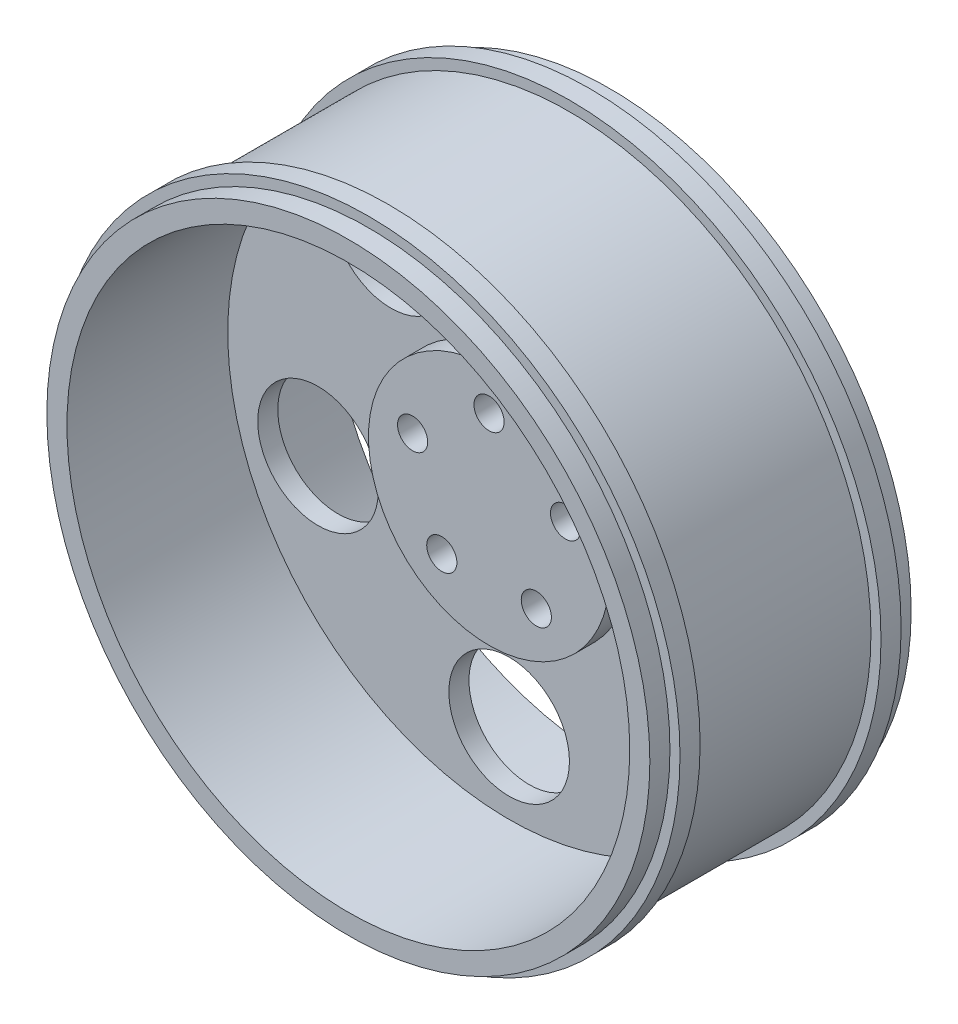
ISO-10303-21;
HEADER;
FILE_DESCRIPTION(('STEP AP214'),'2;1');
FILE_NAME('part.step','',(''),(''),'','','');
FILE_SCHEMA(('AUTOMOTIVE_DESIGN { 1 0 10303 214 1 1 1 1 }'));
ENDSEC;
DATA;
#1=APPLICATION_CONTEXT('core data for automotive mechanical design processes');
#2=APPLICATION_PROTOCOL_DEFINITION('international standard','automotive_design',2000,#1);
#3=PRODUCT_CONTEXT('',#1,'mechanical');
#4=PRODUCT('Part','Part','',(#3));
#5=PRODUCT_RELATED_PRODUCT_CATEGORY('part','',(#4));
#6=PRODUCT_DEFINITION_FORMATION('','',#4);
#7=PRODUCT_DEFINITION_CONTEXT('part definition',#1,'design');
#8=PRODUCT_DEFINITION('design','',#6,#7);
#9=PRODUCT_DEFINITION_SHAPE('','',#8);
#10=(LENGTH_UNIT() NAMED_UNIT(*) SI_UNIT(.MILLI.,.METRE.));
#11=(NAMED_UNIT(*) PLANE_ANGLE_UNIT() SI_UNIT($,.RADIAN.));
#12=(NAMED_UNIT(*) SI_UNIT($,.STERADIAN.) SOLID_ANGLE_UNIT());
#13=UNCERTAINTY_MEASURE_WITH_UNIT(LENGTH_MEASURE(1.E-05),#10,'distance_accuracy_value','');
#14=(GEOMETRIC_REPRESENTATION_CONTEXT(3) GLOBAL_UNCERTAINTY_ASSIGNED_CONTEXT((#13)) GLOBAL_UNIT_ASSIGNED_CONTEXT((#10,
#11,#12)) REPRESENTATION_CONTEXT('',''));
#15=CARTESIAN_POINT('',(0.,0.,0.));
#16=DIRECTION('',(0.,0.,1.));
#17=DIRECTION('',(1.,0.,0.));
#18=AXIS2_PLACEMENT_3D('',#15,#16,#17);
#19=CARTESIAN_POINT('',(0.,140.,0.));
#20=DIRECTION('',(0.,0.,-1.));
#21=DIRECTION('',(-1.,0.,0.));
#22=AXIS2_PLACEMENT_3D('',#19,#20,#21);
#23=PLANE('',#22);
#24=CARTESIAN_POINT('',(-58.7785252292473,80.9016994374947,0.));
#25=DIRECTION('',(0.,0.,1.));
#26=DIRECTION('',(1.,0.,0.));
#27=AXIS2_PLACEMENT_3D('',#24,#25,#26);
#28=CIRCLE('',#27,30.);
#29=CARTESIAN_POINT('',(-28.7785252292473,80.9016994374947,0.));
#30=VERTEX_POINT('',#29);
#31=EDGE_CURVE('E425',#30,#30,#28,.T.);
#32=ORIENTED_EDGE('',*,*,#31,.F.);
#33=EDGE_LOOP('',(#32));
#34=FACE_BOUND('',#33,.T.);
#35=CARTESIAN_POINT('',(0.,-100.,0.));
#36=DIRECTION('',(0.,0.,1.));
#37=DIRECTION('',(1.,0.,0.));
#38=AXIS2_PLACEMENT_3D('',#35,#36,#37);
#39=CIRCLE('',#38,30.);
#40=CARTESIAN_POINT('',(30.,-100.,0.));
#41=VERTEX_POINT('',#40);
#42=EDGE_CURVE('E426',#41,#41,#39,.T.);
#43=ORIENTED_EDGE('',*,*,#42,.F.);
#44=EDGE_LOOP('',(#43));
#45=FACE_BOUND('',#44,.T.);
#46=CARTESIAN_POINT('',(95.1056516295154,-30.9016994374947,0.));
#47=DIRECTION('',(0.,0.,1.));
#48=DIRECTION('',(1.,0.,0.));
#49=AXIS2_PLACEMENT_3D('',#46,#47,#48);
#50=CIRCLE('',#49,29.9999999999999);
#51=CARTESIAN_POINT('',(125.105651629515,-30.9016994374947,0.));
#52=VERTEX_POINT('',#51);
#53=EDGE_CURVE('E432',#52,#52,#50,.T.);
#54=ORIENTED_EDGE('',*,*,#53,.F.);
#55=EDGE_LOOP('',(#54));
#56=FACE_BOUND('',#55,.T.);
#57=CARTESIAN_POINT('',(58.7785252292473,80.9016994374948,0.));
#58=DIRECTION('',(0.,0.,1.));
#59=DIRECTION('',(1.,0.,0.));
#60=AXIS2_PLACEMENT_3D('',#57,#58,#59);
#61=CIRCLE('',#60,29.9999999999999);
#62=CARTESIAN_POINT('',(88.7785252292473,80.9016994374948,0.));
#63=VERTEX_POINT('',#62);
#64=EDGE_CURVE('E429',#63,#63,#61,.T.);
#65=ORIENTED_EDGE('',*,*,#64,.F.);
#66=EDGE_LOOP('',(#65));
#67=FACE_BOUND('',#66,.T.);
#68=CARTESIAN_POINT('',(0.,0.,0.));
#69=DIRECTION('',(0.,0.,1.));
#70=DIRECTION('',(1.,0.,0.));
#71=AXIS2_PLACEMENT_3D('',#68,#69,#70);
#72=CIRCLE('',#71,60.);
#73=CARTESIAN_POINT('',(60.,0.,0.));
#74=VERTEX_POINT('',#73);
#75=EDGE_CURVE('E83',#74,#74,#72,.T.);
#76=ORIENTED_EDGE('',*,*,#75,.F.);
#77=EDGE_LOOP('',(#76));
#78=FACE_BOUND('',#77,.T.);
#79=CARTESIAN_POINT('',(0.,0.,0.));
#80=DIRECTION('',(0.,0.,1.));
#81=DIRECTION('',(1.,0.,0.));
#82=AXIS2_PLACEMENT_3D('',#79,#80,#81);
#83=CIRCLE('',#82,140.);
#84=CARTESIAN_POINT('',(140.,0.,0.));
#85=VERTEX_POINT('',#84);
#86=EDGE_CURVE('E86',#85,#85,#83,.T.);
#87=ORIENTED_EDGE('',*,*,#86,.T.);
#88=EDGE_LOOP('',(#87));
#89=FACE_BOUND('',#88,.T.);
#90=CARTESIAN_POINT('',(-95.1056516295154,-30.9016994374948,0.));
#91=DIRECTION('',(0.,0.,1.));
#92=DIRECTION('',(1.,0.,0.));
#93=AXIS2_PLACEMENT_3D('',#90,#91,#92);
#94=CIRCLE('',#93,30.);
#95=CARTESIAN_POINT('',(-65.1056516295154,-30.9016994374948,0.));
#96=VERTEX_POINT('',#95);
#97=EDGE_CURVE('E396',#96,#96,#94,.T.);
#98=ORIENTED_EDGE('',*,*,#97,.F.);
#99=EDGE_LOOP('',(#98));
#100=FACE_BOUND('',#99,.T.);
#101=ADVANCED_FACE('F34',(#34,#45,#56,#67,#78,#89,#100),#23,.F.);
#102=CARTESIAN_POINT('',(0.,60.,9.99999999999999));
#103=DIRECTION('',(0.,0.,-1.));
#104=DIRECTION('',(-1.,0.,0.));
#105=AXIS2_PLACEMENT_3D('',#102,#103,#104);
#106=PLANE('',#105);
#107=CARTESIAN_POINT('',(0.,40.,9.99999999999999));
#108=DIRECTION('',(0.,0.,-1.));
#109=DIRECTION('',(-1.,0.,0.));
#110=AXIS2_PLACEMENT_3D('',#107,#108,#109);
#111=CIRCLE('',#110,7.5);
#112=CARTESIAN_POINT('',(-7.5,40.,9.99999999999999));
#113=VERTEX_POINT('',#112);
#114=EDGE_CURVE('E68',#113,#113,#111,.T.);
#115=ORIENTED_EDGE('',*,*,#114,.T.);
#116=EDGE_LOOP('',(#115));
#117=FACE_BOUND('',#116,.T.);
#118=CARTESIAN_POINT('',(38.0422606518061,12.3606797749979,9.99999999999999));
#119=DIRECTION('',(0.,0.,-1.));
#120=DIRECTION('',(-1.,0.,0.));
#121=AXIS2_PLACEMENT_3D('',#118,#119,#120);
#122=CIRCLE('',#121,7.50000000000001);
#123=CARTESIAN_POINT('',(30.5422606518061,12.3606797749979,9.99999999999999));
#124=VERTEX_POINT('',#123);
#125=EDGE_CURVE('E65',#124,#124,#122,.T.);
#126=ORIENTED_EDGE('',*,*,#125,.T.);
#127=EDGE_LOOP('',(#126));
#128=FACE_BOUND('',#127,.T.);
#129=CARTESIAN_POINT('',(23.5114100916989,-32.3606797749979,9.99999999999999));
#130=DIRECTION('',(0.,0.,-1.));
#131=DIRECTION('',(-1.,0.,0.));
#132=AXIS2_PLACEMENT_3D('',#129,#130,#131);
#133=CIRCLE('',#132,7.50000000000001);
#134=CARTESIAN_POINT('',(16.0114100916989,-32.3606797749979,9.99999999999999));
#135=VERTEX_POINT('',#134);
#136=EDGE_CURVE('E62',#135,#135,#133,.T.);
#137=ORIENTED_EDGE('',*,*,#136,.T.);
#138=EDGE_LOOP('',(#137));
#139=FACE_BOUND('',#138,.T.);
#140=CARTESIAN_POINT('',(-23.5114100916989,-32.3606797749979,9.99999999999999));
#141=DIRECTION('',(0.,0.,-1.));
#142=DIRECTION('',(-1.,0.,0.));
#143=AXIS2_PLACEMENT_3D('',#140,#141,#142);
#144=CIRCLE('',#143,7.5);
#145=CARTESIAN_POINT('',(-31.0114100916989,-32.3606797749979,9.99999999999999));
#146=VERTEX_POINT('',#145);
#147=EDGE_CURVE('E58',#146,#146,#144,.T.);
#148=ORIENTED_EDGE('',*,*,#147,.T.);
#149=EDGE_LOOP('',(#148));
#150=FACE_BOUND('',#149,.T.);
#151=CARTESIAN_POINT('',(-38.0422606518061,12.3606797749979,9.99999999999999));
#152=DIRECTION('',(0.,0.,-1.));
#153=DIRECTION('',(-1.,0.,0.));
#154=AXIS2_PLACEMENT_3D('',#151,#152,#153);
#155=CIRCLE('',#154,7.5);
#156=CARTESIAN_POINT('',(-45.5422606518061,12.3606797749979,9.99999999999999));
#157=VERTEX_POINT('',#156);
#158=EDGE_CURVE('E54',#157,#157,#155,.T.);
#159=ORIENTED_EDGE('',*,*,#158,.T.);
#160=EDGE_LOOP('',(#159));
#161=FACE_BOUND('',#160,.T.);
#162=CARTESIAN_POINT('',(0.,0.,9.99999999999999));
#163=DIRECTION('',(0.,0.,1.));
#164=DIRECTION('',(1.,0.,0.));
#165=AXIS2_PLACEMENT_3D('',#162,#163,#164);
#166=CIRCLE('',#165,60.);
#167=CARTESIAN_POINT('',(60.,0.,9.99999999999999));
#168=VERTEX_POINT('',#167);
#169=EDGE_CURVE('E72',#168,#168,#166,.T.);
#170=ORIENTED_EDGE('',*,*,#169,.T.);
#171=EDGE_LOOP('',(#170));
#172=FACE_BOUND('',#171,.T.);
#173=ADVANCED_FACE('F36',(#117,#128,#139,#150,#161,#172),#106,.F.);
#174=CARTESIAN_POINT('',(0.,0.,-10.));
#175=DIRECTION('',(0.,0.,1.));
#176=DIRECTION('',(1.,0.,0.));
#177=AXIS2_PLACEMENT_3D('',#174,#175,#176);
#178=PLANE('',#177);
#179=CARTESIAN_POINT('',(-58.7785252292473,80.9016994374947,-10.));
#180=DIRECTION('',(0.,0.,1.));
#181=DIRECTION('',(1.,0.,0.));
#182=AXIS2_PLACEMENT_3D('',#179,#180,#181);
#183=CIRCLE('',#182,30.);
#184=CARTESIAN_POINT('',(-28.7785252292473,80.9016994374947,-10.));
#185=VERTEX_POINT('',#184);
#186=EDGE_CURVE('E400',#185,#185,#183,.T.);
#187=ORIENTED_EDGE('',*,*,#186,.T.);
#188=EDGE_LOOP('',(#187));
#189=FACE_BOUND('',#188,.T.);
#190=CARTESIAN_POINT('',(-95.1056516295154,-30.9016994374948,-10.));
#191=DIRECTION('',(0.,0.,1.));
#192=DIRECTION('',(1.,0.,0.));
#193=AXIS2_PLACEMENT_3D('',#190,#191,#192);
#194=CIRCLE('',#193,30.);
#195=CARTESIAN_POINT('',(-65.1056516295154,-30.9016994374948,-10.));
#196=VERTEX_POINT('',#195);
#197=EDGE_CURVE('E38',#196,#196,#194,.T.);
#198=ORIENTED_EDGE('',*,*,#197,.T.);
#199=EDGE_LOOP('',(#198));
#200=FACE_BOUND('',#199,.T.);
#201=CARTESIAN_POINT('',(0.,-100.,-10.));
#202=DIRECTION('',(0.,0.,1.));
#203=DIRECTION('',(1.,0.,0.));
#204=AXIS2_PLACEMENT_3D('',#201,#202,#203);
#205=CIRCLE('',#204,30.);
#206=CARTESIAN_POINT('',(30.,-100.,-10.));
#207=VERTEX_POINT('',#206);
#208=EDGE_CURVE('E402',#207,#207,#205,.T.);
#209=ORIENTED_EDGE('',*,*,#208,.T.);
#210=EDGE_LOOP('',(#209));
#211=FACE_BOUND('',#210,.T.);
#212=CARTESIAN_POINT('',(95.1056516295154,-30.9016994374947,-10.));
#213=DIRECTION('',(0.,0.,1.));
#214=DIRECTION('',(1.,0.,0.));
#215=AXIS2_PLACEMENT_3D('',#212,#213,#214);
#216=CIRCLE('',#215,29.9999999999999);
#217=CARTESIAN_POINT('',(125.105651629515,-30.9016994374947,-10.));
#218=VERTEX_POINT('',#217);
#219=EDGE_CURVE('E406',#218,#218,#216,.T.);
#220=ORIENTED_EDGE('',*,*,#219,.T.);
#221=EDGE_LOOP('',(#220));
#222=FACE_BOUND('',#221,.T.);
#223=CARTESIAN_POINT('',(58.7785252292473,80.9016994374948,-10.));
#224=DIRECTION('',(0.,0.,1.));
#225=DIRECTION('',(1.,0.,0.));
#226=AXIS2_PLACEMENT_3D('',#223,#224,#225);
#227=CIRCLE('',#226,29.9999999999999);
#228=CARTESIAN_POINT('',(88.7785252292473,80.9016994374948,-10.));
#229=VERTEX_POINT('',#228);
#230=EDGE_CURVE('E438',#229,#229,#227,.T.);
#231=ORIENTED_EDGE('',*,*,#230,.T.);
#232=EDGE_LOOP('',(#231));
#233=FACE_BOUND('',#232,.T.);
#234=CARTESIAN_POINT('',(0.,40.,-10.));
#235=DIRECTION('',(0.,0.,1.));
#236=DIRECTION('',(1.,0.,0.));
#237=AXIS2_PLACEMENT_3D('',#234,#235,#236);
#238=CIRCLE('',#237,7.5);
#239=CARTESIAN_POINT('',(7.5,40.,-10.));
#240=VERTEX_POINT('',#239);
#241=EDGE_CURVE('E66',#240,#240,#238,.T.);
#242=ORIENTED_EDGE('',*,*,#241,.T.);
#243=EDGE_LOOP('',(#242));
#244=FACE_BOUND('',#243,.T.);
#245=CARTESIAN_POINT('',(38.0422606518061,12.3606797749979,-10.));
#246=DIRECTION('',(0.,0.,1.));
#247=DIRECTION('',(1.,0.,0.));
#248=AXIS2_PLACEMENT_3D('',#245,#246,#247);
#249=CIRCLE('',#248,7.50000000000001);
#250=CARTESIAN_POINT('',(45.5422606518062,12.3606797749979,-10.));
#251=VERTEX_POINT('',#250);
#252=EDGE_CURVE('E63',#251,#251,#249,.T.);
#253=ORIENTED_EDGE('',*,*,#252,.T.);
#254=EDGE_LOOP('',(#253));
#255=FACE_BOUND('',#254,.T.);
#256=CARTESIAN_POINT('',(23.5114100916989,-32.3606797749979,-10.));
#257=DIRECTION('',(0.,0.,1.));
#258=DIRECTION('',(1.,0.,0.));
#259=AXIS2_PLACEMENT_3D('',#256,#257,#258);
#260=CIRCLE('',#259,7.50000000000001);
#261=CARTESIAN_POINT('',(31.0114100916989,-32.3606797749979,-10.));
#262=VERTEX_POINT('',#261);
#263=EDGE_CURVE('E59',#262,#262,#260,.T.);
#264=ORIENTED_EDGE('',*,*,#263,.T.);
#265=EDGE_LOOP('',(#264));
#266=FACE_BOUND('',#265,.T.);
#267=CARTESIAN_POINT('',(-23.5114100916989,-32.3606797749979,-10.));
#268=DIRECTION('',(0.,0.,1.));
#269=DIRECTION('',(1.,0.,0.));
#270=AXIS2_PLACEMENT_3D('',#267,#268,#269);
#271=CIRCLE('',#270,7.5);
#272=CARTESIAN_POINT('',(-16.0114100916989,-32.3606797749979,-10.));
#273=VERTEX_POINT('',#272);
#274=EDGE_CURVE('E55',#273,#273,#271,.T.);
#275=ORIENTED_EDGE('',*,*,#274,.T.);
#276=EDGE_LOOP('',(#275));
#277=FACE_BOUND('',#276,.T.);
#278=CARTESIAN_POINT('',(-38.0422606518061,12.3606797749979,-10.));
#279=DIRECTION('',(0.,0.,1.));
#280=DIRECTION('',(1.,0.,0.));
#281=AXIS2_PLACEMENT_3D('',#278,#279,#280);
#282=CIRCLE('',#281,7.5);
#283=CARTESIAN_POINT('',(-30.5422606518061,12.3606797749979,-10.));
#284=VERTEX_POINT('',#283);
#285=EDGE_CURVE('E51',#284,#284,#282,.T.);
#286=ORIENTED_EDGE('',*,*,#285,.T.);
#287=EDGE_LOOP('',(#286));
#288=FACE_BOUND('',#287,.T.);
#289=CARTESIAN_POINT('',(0.,0.,-10.));
#290=DIRECTION('',(0.,0.,1.));
#291=DIRECTION('',(1.,0.,0.));
#292=AXIS2_PLACEMENT_3D('',#289,#290,#291);
#293=CIRCLE('',#292,140.);
#294=CARTESIAN_POINT('',(140.,0.,-10.));
#295=VERTEX_POINT('',#294);
#296=EDGE_CURVE('E10',#295,#295,#293,.T.);
#297=ORIENTED_EDGE('',*,*,#296,.F.);
#298=EDGE_LOOP('',(#297));
#299=FACE_BOUND('',#298,.T.);
#300=ADVANCED_FACE('F131',(#189,#200,#211,#222,#233,#244,#255,#266,#277,#288,#299),#178,.F.);
#301=CARTESIAN_POINT('',(0.,0.,9.99999999999998));
#302=DIRECTION('',(0.,0.,1.));
#303=DIRECTION('',(1.,0.,0.));
#304=AXIS2_PLACEMENT_3D('',#301,#302,#303);
#305=CYLINDRICAL_SURFACE('',#304,140.);
#306=CARTESIAN_POINT('',(0.,0.,-50.));
#307=DIRECTION('',(0.,0.,1.));
#308=DIRECTION('',(1.,0.,0.));
#309=AXIS2_PLACEMENT_3D('',#306,#307,#308);
#310=CIRCLE('',#309,140.);
#311=CARTESIAN_POINT('',(140.,0.,-50.));
#312=VERTEX_POINT('',#311);
#313=EDGE_CURVE('E42',#312,#312,#310,.T.);
#314=ORIENTED_EDGE('',*,*,#313,.F.);
#315=EDGE_LOOP('',(#314));
#316=FACE_BOUND('',#315,.T.);
#317=ORIENTED_EDGE('',*,*,#296,.T.);
#318=EDGE_LOOP('',(#317));
#319=FACE_BOUND('',#318,.T.);
#320=ADVANCED_FACE('F126',(#316,#319),#305,.F.);
#321=CARTESIAN_POINT('',(0.,140.,-50.));
#322=DIRECTION('',(0.,0.,1.));
#323=DIRECTION('',(1.,0.,0.));
#324=AXIS2_PLACEMENT_3D('',#321,#322,#323);
#325=PLANE('',#324);
#326=CARTESIAN_POINT('',(0.,0.,-50.));
#327=DIRECTION('',(0.,0.,1.));
#328=DIRECTION('',(1.,0.,0.));
#329=AXIS2_PLACEMENT_3D('',#326,#327,#328);
#330=CIRCLE('',#329,150.);
#331=CARTESIAN_POINT('',(150.,0.,-50.));
#332=VERTEX_POINT('',#331);
#333=EDGE_CURVE('E47',#332,#332,#330,.T.);
#334=ORIENTED_EDGE('',*,*,#333,.F.);
#335=EDGE_LOOP('',(#334));
#336=FACE_BOUND('',#335,.T.);
#337=ORIENTED_EDGE('',*,*,#313,.T.);
#338=EDGE_LOOP('',(#337));
#339=FACE_BOUND('',#338,.T.);
#340=ADVANCED_FACE('F123',(#336,#339),#325,.F.);
#341=CARTESIAN_POINT('',(0.,0.,9.99999999999998));
#342=DIRECTION('',(0.,0.,1.));
#343=DIRECTION('',(1.,0.,0.));
#344=AXIS2_PLACEMENT_3D('',#341,#342,#343);
#345=CYLINDRICAL_SURFACE('',#344,150.);
#346=CARTESIAN_POINT('',(0.,0.,-40.));
#347=DIRECTION('',(0.,0.,1.));
#348=DIRECTION('',(1.,0.,0.));
#349=AXIS2_PLACEMENT_3D('',#346,#347,#348);
#350=CIRCLE('',#349,150.);
#351=CARTESIAN_POINT('',(150.,0.,-40.));
#352=VERTEX_POINT('',#351);
#353=EDGE_CURVE('E116',#352,#352,#350,.T.);
#354=ORIENTED_EDGE('',*,*,#353,.F.);
#355=EDGE_LOOP('',(#354));
#356=FACE_BOUND('',#355,.T.);
#357=ORIENTED_EDGE('',*,*,#333,.T.);
#358=EDGE_LOOP('',(#357));
#359=FACE_BOUND('',#358,.T.);
#360=ADVANCED_FACE('F121',(#356,#359),#345,.T.);
#361=CARTESIAN_POINT('',(0.,150.,-40.));
#362=DIRECTION('',(0.,0.,1.));
#363=DIRECTION('',(1.,0.,0.));
#364=AXIS2_PLACEMENT_3D('',#361,#362,#363);
#365=PLANE('',#364);
#366=CARTESIAN_POINT('',(0.,0.,-40.));
#367=DIRECTION('',(0.,0.,1.));
#368=DIRECTION('',(1.,0.,0.));
#369=AXIS2_PLACEMENT_3D('',#366,#367,#368);
#370=CIRCLE('',#369,155.);
#371=CARTESIAN_POINT('',(155.,0.,-40.));
#372=VERTEX_POINT('',#371);
#373=EDGE_CURVE('E113',#372,#372,#370,.T.);
#374=ORIENTED_EDGE('',*,*,#373,.F.);
#375=EDGE_LOOP('',(#374));
#376=FACE_BOUND('',#375,.T.);
#377=ORIENTED_EDGE('',*,*,#353,.T.);
#378=EDGE_LOOP('',(#377));
#379=FACE_BOUND('',#378,.T.);
#380=ADVANCED_FACE('F185',(#376,#379),#365,.F.);
#381=CARTESIAN_POINT('',(0.,0.,9.99999999999998));
#382=DIRECTION('',(0.,0.,1.));
#383=DIRECTION('',(1.,0.,0.));
#384=AXIS2_PLACEMENT_3D('',#381,#382,#383);
#385=CYLINDRICAL_SURFACE('',#384,155.);
#386=CARTESIAN_POINT('',(0.,0.,-30.));
#387=DIRECTION('',(0.,0.,1.));
#388=DIRECTION('',(1.,0.,0.));
#389=AXIS2_PLACEMENT_3D('',#386,#387,#388);
#390=CIRCLE('',#389,155.);
#391=CARTESIAN_POINT('',(155.,0.,-30.));
#392=VERTEX_POINT('',#391);
#393=EDGE_CURVE('E110',#392,#392,#390,.T.);
#394=ORIENTED_EDGE('',*,*,#393,.F.);
#395=EDGE_LOOP('',(#394));
#396=FACE_BOUND('',#395,.T.);
#397=ORIENTED_EDGE('',*,*,#373,.T.);
#398=EDGE_LOOP('',(#397));
#399=FACE_BOUND('',#398,.T.);
#400=ADVANCED_FACE('F181',(#396,#399),#385,.T.);
#401=CARTESIAN_POINT('',(0.,155.,-30.));
#402=DIRECTION('',(0.,0.,-1.));
#403=DIRECTION('',(-1.,0.,0.));
#404=AXIS2_PLACEMENT_3D('',#401,#402,#403);
#405=PLANE('',#404);
#406=CARTESIAN_POINT('',(0.,0.,-30.));
#407=DIRECTION('',(0.,0.,1.));
#408=DIRECTION('',(1.,0.,0.));
#409=AXIS2_PLACEMENT_3D('',#406,#407,#408);
#410=CIRCLE('',#409,150.);
#411=CARTESIAN_POINT('',(150.,0.,-30.));
#412=VERTEX_POINT('',#411);
#413=EDGE_CURVE('E107',#412,#412,#410,.T.);
#414=ORIENTED_EDGE('',*,*,#413,.F.);
#415=EDGE_LOOP('',(#414));
#416=FACE_BOUND('',#415,.T.);
#417=ORIENTED_EDGE('',*,*,#393,.T.);
#418=EDGE_LOOP('',(#417));
#419=FACE_BOUND('',#418,.T.);
#420=ADVANCED_FACE('F177',(#416,#419),#405,.F.);
#421=CARTESIAN_POINT('',(0.,0.,9.99999999999998));
#422=DIRECTION('',(0.,0.,1.));
#423=DIRECTION('',(1.,0.,0.));
#424=AXIS2_PLACEMENT_3D('',#421,#422,#423);
#425=CYLINDRICAL_SURFACE('',#424,150.);
#426=CARTESIAN_POINT('',(0.,0.,60.));
#427=DIRECTION('',(0.,0.,1.));
#428=DIRECTION('',(1.,0.,0.));
#429=AXIS2_PLACEMENT_3D('',#426,#427,#428);
#430=CIRCLE('',#429,150.);
#431=CARTESIAN_POINT('',(150.,0.,60.));
#432=VERTEX_POINT('',#431);
#433=EDGE_CURVE('E104',#432,#432,#430,.T.);
#434=ORIENTED_EDGE('',*,*,#433,.F.);
#435=EDGE_LOOP('',(#434));
#436=FACE_BOUND('',#435,.T.);
#437=ORIENTED_EDGE('',*,*,#413,.T.);
#438=EDGE_LOOP('',(#437));
#439=FACE_BOUND('',#438,.T.);
#440=ADVANCED_FACE('F173',(#436,#439),#425,.T.);
#441=CARTESIAN_POINT('',(0.,150.,60.));
#442=DIRECTION('',(0.,0.,1.));
#443=DIRECTION('',(1.,0.,0.));
#444=AXIS2_PLACEMENT_3D('',#441,#442,#443);
#445=PLANE('',#444);
#446=CARTESIAN_POINT('',(0.,0.,60.));
#447=DIRECTION('',(0.,0.,1.));
#448=DIRECTION('',(1.,0.,0.));
#449=AXIS2_PLACEMENT_3D('',#446,#447,#448);
#450=CIRCLE('',#449,155.);
#451=CARTESIAN_POINT('',(155.,0.,60.));
#452=VERTEX_POINT('',#451);
#453=EDGE_CURVE('E101',#452,#452,#450,.T.);
#454=ORIENTED_EDGE('',*,*,#453,.F.);
#455=EDGE_LOOP('',(#454));
#456=FACE_BOUND('',#455,.T.);
#457=ORIENTED_EDGE('',*,*,#433,.T.);
#458=EDGE_LOOP('',(#457));
#459=FACE_BOUND('',#458,.T.);
#460=ADVANCED_FACE('F169',(#456,#459),#445,.F.);
#461=CARTESIAN_POINT('',(0.,0.,9.99999999999998));
#462=DIRECTION('',(0.,0.,1.));
#463=DIRECTION('',(1.,0.,0.));
#464=AXIS2_PLACEMENT_3D('',#461,#462,#463);
#465=CYLINDRICAL_SURFACE('',#464,155.);
#466=CARTESIAN_POINT('',(0.,0.,70.));
#467=DIRECTION('',(0.,0.,1.));
#468=DIRECTION('',(1.,0.,0.));
#469=AXIS2_PLACEMENT_3D('',#466,#467,#468);
#470=CIRCLE('',#469,155.);
#471=CARTESIAN_POINT('',(155.,0.,70.));
#472=VERTEX_POINT('',#471);
#473=EDGE_CURVE('E98',#472,#472,#470,.T.);
#474=ORIENTED_EDGE('',*,*,#473,.F.);
#475=EDGE_LOOP('',(#474));
#476=FACE_BOUND('',#475,.T.);
#477=ORIENTED_EDGE('',*,*,#453,.T.);
#478=EDGE_LOOP('',(#477));
#479=FACE_BOUND('',#478,.T.);
#480=ADVANCED_FACE('F165',(#476,#479),#465,.T.);
#481=CARTESIAN_POINT('',(0.,155.,70.));
#482=DIRECTION('',(0.,0.,-1.));
#483=DIRECTION('',(-1.,0.,0.));
#484=AXIS2_PLACEMENT_3D('',#481,#482,#483);
#485=PLANE('',#484);
#486=CARTESIAN_POINT('',(0.,0.,70.));
#487=DIRECTION('',(0.,0.,1.));
#488=DIRECTION('',(1.,0.,0.));
#489=AXIS2_PLACEMENT_3D('',#486,#487,#488);
#490=CIRCLE('',#489,150.);
#491=CARTESIAN_POINT('',(150.,0.,70.));
#492=VERTEX_POINT('',#491);
#493=EDGE_CURVE('E95',#492,#492,#490,.T.);
#494=ORIENTED_EDGE('',*,*,#493,.F.);
#495=EDGE_LOOP('',(#494));
#496=FACE_BOUND('',#495,.T.);
#497=ORIENTED_EDGE('',*,*,#473,.T.);
#498=EDGE_LOOP('',(#497));
#499=FACE_BOUND('',#498,.T.);
#500=ADVANCED_FACE('F161',(#496,#499),#485,.F.);
#501=CARTESIAN_POINT('',(0.,0.,9.99999999999998));
#502=DIRECTION('',(0.,0.,1.));
#503=DIRECTION('',(1.,0.,0.));
#504=AXIS2_PLACEMENT_3D('',#501,#502,#503);
#505=CYLINDRICAL_SURFACE('',#504,150.);
#506=CARTESIAN_POINT('',(0.,0.,80.));
#507=DIRECTION('',(0.,0.,1.));
#508=DIRECTION('',(1.,0.,0.));
#509=AXIS2_PLACEMENT_3D('',#506,#507,#508);
#510=CIRCLE('',#509,150.);
#511=CARTESIAN_POINT('',(150.,0.,80.));
#512=VERTEX_POINT('',#511);
#513=EDGE_CURVE('E92',#512,#512,#510,.T.);
#514=ORIENTED_EDGE('',*,*,#513,.F.);
#515=EDGE_LOOP('',(#514));
#516=FACE_BOUND('',#515,.T.);
#517=ORIENTED_EDGE('',*,*,#493,.T.);
#518=EDGE_LOOP('',(#517));
#519=FACE_BOUND('',#518,.T.);
#520=ADVANCED_FACE('F157',(#516,#519),#505,.T.);
#521=CARTESIAN_POINT('',(0.,150.,80.));
#522=DIRECTION('',(0.,0.,-1.));
#523=DIRECTION('',(-1.,0.,0.));
#524=AXIS2_PLACEMENT_3D('',#521,#522,#523);
#525=PLANE('',#524);
#526=CARTESIAN_POINT('',(0.,0.,80.));
#527=DIRECTION('',(0.,0.,1.));
#528=DIRECTION('',(1.,0.,0.));
#529=AXIS2_PLACEMENT_3D('',#526,#527,#528);
#530=CIRCLE('',#529,140.);
#531=CARTESIAN_POINT('',(140.,0.,80.));
#532=VERTEX_POINT('',#531);
#533=EDGE_CURVE('E89',#532,#532,#530,.T.);
#534=ORIENTED_EDGE('',*,*,#533,.F.);
#535=EDGE_LOOP('',(#534));
#536=FACE_BOUND('',#535,.T.);
#537=ORIENTED_EDGE('',*,*,#513,.T.);
#538=EDGE_LOOP('',(#537));
#539=FACE_BOUND('',#538,.T.);
#540=ADVANCED_FACE('F153',(#536,#539),#525,.F.);
#541=CARTESIAN_POINT('',(0.,0.,9.99999999999998));
#542=DIRECTION('',(0.,0.,1.));
#543=DIRECTION('',(1.,0.,0.));
#544=AXIS2_PLACEMENT_3D('',#541,#542,#543);
#545=CYLINDRICAL_SURFACE('',#544,140.);
#546=ORIENTED_EDGE('',*,*,#86,.F.);
#547=EDGE_LOOP('',(#546));
#548=FACE_BOUND('',#547,.T.);
#549=ORIENTED_EDGE('',*,*,#533,.T.);
#550=EDGE_LOOP('',(#549));
#551=FACE_BOUND('',#550,.T.);
#552=ADVANCED_FACE('F150',(#548,#551),#545,.F.);
#553=CARTESIAN_POINT('',(0.,0.,9.99999999999998));
#554=DIRECTION('',(0.,0.,1.));
#555=DIRECTION('',(1.,0.,0.));
#556=AXIS2_PLACEMENT_3D('',#553,#554,#555);
#557=CYLINDRICAL_SURFACE('',#556,60.);
#558=ORIENTED_EDGE('',*,*,#169,.F.);
#559=EDGE_LOOP('',(#558));
#560=FACE_BOUND('',#559,.T.);
#561=ORIENTED_EDGE('',*,*,#75,.T.);
#562=EDGE_LOOP('',(#561));
#563=FACE_BOUND('',#562,.T.);
#564=ADVANCED_FACE('F148',(#560,#563),#557,.T.);
#565=CARTESIAN_POINT('',(-38.0422606518061,12.3606797749979,-50.));
#566=DIRECTION('',(0.,0.,1.));
#567=DIRECTION('',(1.,0.,0.));
#568=AXIS2_PLACEMENT_3D('',#565,#566,#567);
#569=CYLINDRICAL_SURFACE('',#568,7.5);
#570=ORIENTED_EDGE('',*,*,#285,.F.);
#571=EDGE_LOOP('',(#570));
#572=FACE_BOUND('',#571,.T.);
#573=ORIENTED_EDGE('',*,*,#158,.F.);
#574=EDGE_LOOP('',(#573));
#575=FACE_BOUND('',#574,.T.);
#576=ADVANCED_FACE('F244',(#572,#575),#569,.F.);
#577=CARTESIAN_POINT('',(-23.5114100916989,-32.3606797749979,-50.));
#578=DIRECTION('',(0.,0.,1.));
#579=DIRECTION('',(1.,0.,0.));
#580=AXIS2_PLACEMENT_3D('',#577,#578,#579);
#581=CYLINDRICAL_SURFACE('',#580,7.5);
#582=ORIENTED_EDGE('',*,*,#274,.F.);
#583=EDGE_LOOP('',(#582));
#584=FACE_BOUND('',#583,.T.);
#585=ORIENTED_EDGE('',*,*,#147,.F.);
#586=EDGE_LOOP('',(#585));
#587=FACE_BOUND('',#586,.T.);
#588=ADVANCED_FACE('F252',(#584,#587),#581,.F.);
#589=CARTESIAN_POINT('',(23.5114100916989,-32.3606797749979,-50.));
#590=DIRECTION('',(0.,0.,1.));
#591=DIRECTION('',(1.,0.,0.));
#592=AXIS2_PLACEMENT_3D('',#589,#590,#591);
#593=CYLINDRICAL_SURFACE('',#592,7.50000000000001);
#594=ORIENTED_EDGE('',*,*,#263,.F.);
#595=EDGE_LOOP('',(#594));
#596=FACE_BOUND('',#595,.T.);
#597=ORIENTED_EDGE('',*,*,#136,.F.);
#598=EDGE_LOOP('',(#597));
#599=FACE_BOUND('',#598,.T.);
#600=ADVANCED_FACE('F259',(#596,#599),#593,.F.);
#601=CARTESIAN_POINT('',(38.0422606518061,12.3606797749979,-50.));
#602=DIRECTION('',(0.,0.,1.));
#603=DIRECTION('',(1.,0.,0.));
#604=AXIS2_PLACEMENT_3D('',#601,#602,#603);
#605=CYLINDRICAL_SURFACE('',#604,7.50000000000001);
#606=ORIENTED_EDGE('',*,*,#252,.F.);
#607=EDGE_LOOP('',(#606));
#608=FACE_BOUND('',#607,.T.);
#609=ORIENTED_EDGE('',*,*,#125,.F.);
#610=EDGE_LOOP('',(#609));
#611=FACE_BOUND('',#610,.T.);
#612=ADVANCED_FACE('F267',(#608,#611),#605,.F.);
#613=CARTESIAN_POINT('',(0.,40.,-50.));
#614=DIRECTION('',(0.,0.,1.));
#615=DIRECTION('',(1.,0.,0.));
#616=AXIS2_PLACEMENT_3D('',#613,#614,#615);
#617=CYLINDRICAL_SURFACE('',#616,7.5);
#618=ORIENTED_EDGE('',*,*,#241,.F.);
#619=EDGE_LOOP('',(#618));
#620=FACE_BOUND('',#619,.T.);
#621=ORIENTED_EDGE('',*,*,#114,.F.);
#622=EDGE_LOOP('',(#621));
#623=FACE_BOUND('',#622,.T.);
#624=ADVANCED_FACE('F275',(#620,#623),#617,.F.);
#625=CARTESIAN_POINT('',(58.7785252292473,80.9016994374948,-50.));
#626=DIRECTION('',(0.,0.,1.));
#627=DIRECTION('',(1.,0.,0.));
#628=AXIS2_PLACEMENT_3D('',#625,#626,#627);
#629=CYLINDRICAL_SURFACE('',#628,29.9999999999999);
#630=ORIENTED_EDGE('',*,*,#64,.T.);
#631=EDGE_LOOP('',(#630));
#632=FACE_BOUND('',#631,.T.);
#633=ORIENTED_EDGE('',*,*,#230,.F.);
#634=EDGE_LOOP('',(#633));
#635=FACE_BOUND('',#634,.T.);
#636=ADVANCED_FACE('F283',(#632,#635),#629,.F.);
#637=CARTESIAN_POINT('',(95.1056516295154,-30.9016994374947,-50.));
#638=DIRECTION('',(0.,0.,1.));
#639=DIRECTION('',(1.,0.,0.));
#640=AXIS2_PLACEMENT_3D('',#637,#638,#639);
#641=CYLINDRICAL_SURFACE('',#640,29.9999999999999);
#642=ORIENTED_EDGE('',*,*,#53,.T.);
#643=EDGE_LOOP('',(#642));
#644=FACE_BOUND('',#643,.T.);
#645=ORIENTED_EDGE('',*,*,#219,.F.);
#646=EDGE_LOOP('',(#645));
#647=FACE_BOUND('',#646,.T.);
#648=ADVANCED_FACE('F291',(#644,#647),#641,.F.);
#649=CARTESIAN_POINT('',(0.,-100.,-50.));
#650=DIRECTION('',(0.,0.,1.));
#651=DIRECTION('',(1.,0.,0.));
#652=AXIS2_PLACEMENT_3D('',#649,#650,#651);
#653=CYLINDRICAL_SURFACE('',#652,30.);
#654=ORIENTED_EDGE('',*,*,#42,.T.);
#655=EDGE_LOOP('',(#654));
#656=FACE_BOUND('',#655,.T.);
#657=ORIENTED_EDGE('',*,*,#208,.F.);
#658=EDGE_LOOP('',(#657));
#659=FACE_BOUND('',#658,.T.);
#660=ADVANCED_FACE('F300',(#656,#659),#653,.F.);
#661=CARTESIAN_POINT('',(-58.7785252292473,80.9016994374947,-50.));
#662=DIRECTION('',(0.,0.,1.));
#663=DIRECTION('',(1.,0.,0.));
#664=AXIS2_PLACEMENT_3D('',#661,#662,#663);
#665=CYLINDRICAL_SURFACE('',#664,30.);
#666=ORIENTED_EDGE('',*,*,#31,.T.);
#667=EDGE_LOOP('',(#666));
#668=FACE_BOUND('',#667,.T.);
#669=ORIENTED_EDGE('',*,*,#186,.F.);
#670=EDGE_LOOP('',(#669));
#671=FACE_BOUND('',#670,.T.);
#672=ADVANCED_FACE('F308',(#668,#671),#665,.F.);
#673=CARTESIAN_POINT('',(-95.1056516295154,-30.9016994374948,-50.));
#674=DIRECTION('',(0.,0.,1.));
#675=DIRECTION('',(1.,0.,0.));
#676=AXIS2_PLACEMENT_3D('',#673,#674,#675);
#677=CYLINDRICAL_SURFACE('',#676,30.);
#678=ORIENTED_EDGE('',*,*,#97,.T.);
#679=EDGE_LOOP('',(#678));
#680=FACE_BOUND('',#679,.T.);
#681=ORIENTED_EDGE('',*,*,#197,.F.);
#682=EDGE_LOOP('',(#681));
#683=FACE_BOUND('',#682,.T.);
#684=ADVANCED_FACE('F316',(#680,#683),#677,.F.);
#685=CLOSED_SHELL('',(#101,#173,#300,#320,#340,#360,#380,#400,#420,#440,#460,#480,#500,#520,
#540,#552,#564,#576,#588,#600,#612,#624,#636,#648,#660,#672,#684));
#686=MANIFOLD_SOLID_BREP('B2',#685);
#687=ADVANCED_BREP_SHAPE_REPRESENTATION('',(#18,#686),#14);
#688=SHAPE_DEFINITION_REPRESENTATION(#9,#687);
ENDSEC;
END-ISO-10303-21;
